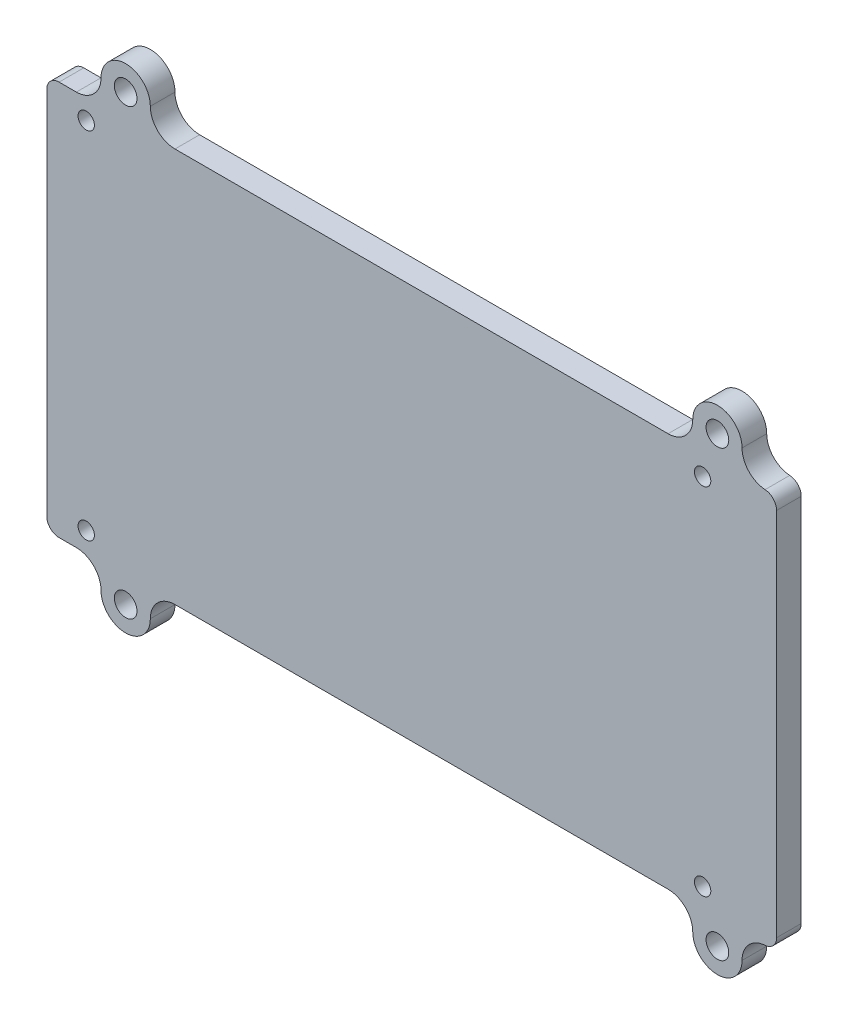
ISO-10303-21;
HEADER;
FILE_DESCRIPTION(('STEP AP214'),'2;1');
FILE_NAME('part.step','',(''),(''),'','','');
FILE_SCHEMA(('AUTOMOTIVE_DESIGN { 1 0 10303 214 1 1 1 1 }'));
ENDSEC;
DATA;
#1=APPLICATION_CONTEXT('core data for automotive mechanical design processes');
#2=APPLICATION_PROTOCOL_DEFINITION('international standard','automotive_design',2000,#1);
#3=PRODUCT_CONTEXT('',#1,'mechanical');
#4=PRODUCT('Part','Part','',(#3));
#5=PRODUCT_RELATED_PRODUCT_CATEGORY('part','',(#4));
#6=PRODUCT_DEFINITION_FORMATION('','',#4);
#7=PRODUCT_DEFINITION_CONTEXT('part definition',#1,'design');
#8=PRODUCT_DEFINITION('design','',#6,#7);
#9=PRODUCT_DEFINITION_SHAPE('','',#8);
#10=(LENGTH_UNIT() NAMED_UNIT(*) SI_UNIT(.MILLI.,.METRE.));
#11=(NAMED_UNIT(*) PLANE_ANGLE_UNIT() SI_UNIT($,.RADIAN.));
#12=(NAMED_UNIT(*) SI_UNIT($,.STERADIAN.) SOLID_ANGLE_UNIT());
#13=UNCERTAINTY_MEASURE_WITH_UNIT(LENGTH_MEASURE(1.E-05),#10,'distance_accuracy_value','');
#14=(GEOMETRIC_REPRESENTATION_CONTEXT(3) GLOBAL_UNCERTAINTY_ASSIGNED_CONTEXT((#13)) GLOBAL_UNIT_ASSIGNED_CONTEXT((#10,
#11,#12)) REPRESENTATION_CONTEXT('',''));
#15=CARTESIAN_POINT('',(0.,0.,0.));
#16=DIRECTION('',(0.,0.,1.));
#17=DIRECTION('',(1.,0.,0.));
#18=AXIS2_PLACEMENT_3D('',#15,#16,#17);
#19=CARTESIAN_POINT('',(90.805,53.975,0.));
#20=DIRECTION('',(0.,0.,1.));
#21=DIRECTION('',(1.,0.,0.));
#22=AXIS2_PLACEMENT_3D('',#19,#20,#21);
#23=CYLINDRICAL_SURFACE('',#22,3.175);
#24=DIRECTION('',(0.,0.,1.));
#25=VECTOR('',#24,1.);
#26=CARTESIAN_POINT('',(93.98,53.975,1.5875));
#27=LINE('',#26,#25);
#28=CARTESIAN_POINT('',(93.98,53.975,0.));
#29=VERTEX_POINT('',#28);
#30=CARTESIAN_POINT('',(93.98,53.975,3.175));
#31=VERTEX_POINT('',#30);
#32=EDGE_CURVE('E222',#29,#31,#27,.T.);
#33=ORIENTED_EDGE('',*,*,#32,.F.);
#34=CARTESIAN_POINT('',(90.805,53.975,0.));
#35=DIRECTION('',(0.,0.,1.));
#36=DIRECTION('',(1.,0.,0.));
#37=AXIS2_PLACEMENT_3D('',#34,#35,#36);
#38=CIRCLE('',#37,3.175);
#39=CARTESIAN_POINT('',(87.63,53.975,0.));
#40=VERTEX_POINT('',#39);
#41=EDGE_CURVE('E327',#40,#29,#38,.F.);
#42=ORIENTED_EDGE('',*,*,#41,.F.);
#43=DIRECTION('',(0.,0.,-1.));
#44=VECTOR('',#43,1.);
#45=CARTESIAN_POINT('',(87.63,53.975,1.5875));
#46=LINE('',#45,#44);
#47=CARTESIAN_POINT('',(87.63,53.975,3.175));
#48=VERTEX_POINT('',#47);
#49=EDGE_CURVE('E220',#48,#40,#46,.T.);
#50=ORIENTED_EDGE('',*,*,#49,.F.);
#51=CARTESIAN_POINT('',(90.805,53.975,3.175));
#52=DIRECTION('',(0.,0.,1.));
#53=DIRECTION('',(1.,0.,0.));
#54=AXIS2_PLACEMENT_3D('',#51,#52,#53);
#55=CIRCLE('',#54,3.175);
#56=EDGE_CURVE('E296',#31,#48,#55,.T.);
#57=ORIENTED_EDGE('',*,*,#56,.F.);
#58=EDGE_LOOP('',(#33,#42,#50,#57));
#59=FACE_BOUND('',#58,.T.);
#60=ADVANCED_FACE('F16',(#59),#23,.T.);
#61=CARTESIAN_POINT('',(84.455,53.975,3.175));
#62=DIRECTION('',(0.,0.,-1.));
#63=DIRECTION('',(-1.,0.,0.));
#64=AXIS2_PLACEMENT_3D('',#61,#62,#63);
#65=CYLINDRICAL_SURFACE('',#64,3.175);
#66=CARTESIAN_POINT('',(84.455,53.975,0.));
#67=DIRECTION('',(0.,0.,-1.));
#68=DIRECTION('',(-1.,0.,0.));
#69=AXIS2_PLACEMENT_3D('',#66,#67,#68);
#70=CIRCLE('',#69,3.175);
#71=CARTESIAN_POINT('',(84.455,50.8,0.));
#72=VERTEX_POINT('',#71);
#73=EDGE_CURVE('E329',#72,#40,#70,.F.);
#74=ORIENTED_EDGE('',*,*,#73,.F.);
#75=DIRECTION('',(0.,0.,-1.));
#76=VECTOR('',#75,1.);
#77=CARTESIAN_POINT('',(84.455,50.8,1.5875));
#78=LINE('',#77,#76);
#79=CARTESIAN_POINT('',(84.455,50.8,3.175));
#80=VERTEX_POINT('',#79);
#81=EDGE_CURVE('E218',#80,#72,#78,.T.);
#82=ORIENTED_EDGE('',*,*,#81,.F.);
#83=CARTESIAN_POINT('',(84.455,53.975,3.175));
#84=DIRECTION('',(0.,0.,-1.));
#85=DIRECTION('',(-1.,0.,0.));
#86=AXIS2_PLACEMENT_3D('',#83,#84,#85);
#87=CIRCLE('',#86,3.175);
#88=EDGE_CURVE('E293',#48,#80,#87,.T.);
#89=ORIENTED_EDGE('',*,*,#88,.F.);
#90=ORIENTED_EDGE('',*,*,#49,.T.);
#91=EDGE_LOOP('',(#74,#82,#89,#90));
#92=FACE_BOUND('',#91,.T.);
#93=ADVANCED_FACE('F454',(#92),#65,.F.);
#94=CARTESIAN_POINT('',(84.455,50.8,0.));
#95=DIRECTION('',(0.,1.,0.));
#96=DIRECTION('',(-1.,0.,0.));
#97=AXIS2_PLACEMENT_3D('',#94,#95,#96);
#98=PLANE('',#97);
#99=DIRECTION('',(0.,0.,-1.));
#100=VECTOR('',#99,1.);
#101=CARTESIAN_POINT('',(20.955,50.8,1.5875));
#102=LINE('',#101,#100);
#103=CARTESIAN_POINT('',(20.955,50.8,3.175));
#104=VERTEX_POINT('',#103);
#105=CARTESIAN_POINT('',(20.955,50.8,0.));
#106=VERTEX_POINT('',#105);
#107=EDGE_CURVE('E216',#104,#106,#102,.T.);
#108=ORIENTED_EDGE('',*,*,#107,.F.);
#109=DIRECTION('',(-1.,0.,0.));
#110=VECTOR('',#109,1.);
#111=CARTESIAN_POINT('',(51.435,50.8,3.175));
#112=LINE('',#111,#110);
#113=EDGE_CURVE('E292',#80,#104,#112,.T.);
#114=ORIENTED_EDGE('',*,*,#113,.F.);
#115=ORIENTED_EDGE('',*,*,#81,.T.);
#116=DIRECTION('',(1.,0.,0.));
#117=VECTOR('',#116,1.);
#118=CARTESIAN_POINT('',(51.435,50.8,0.));
#119=LINE('',#118,#117);
#120=EDGE_CURVE('E332',#106,#72,#119,.T.);
#121=ORIENTED_EDGE('',*,*,#120,.F.);
#122=EDGE_LOOP('',(#108,#114,#115,#121));
#123=FACE_BOUND('',#122,.T.);
#124=ADVANCED_FACE('F450',(#123),#98,.T.);
#125=CARTESIAN_POINT('',(20.955,53.975,0.));
#126=DIRECTION('',(0.,0.,1.));
#127=DIRECTION('',(1.,0.,0.));
#128=AXIS2_PLACEMENT_3D('',#125,#126,#127);
#129=CYLINDRICAL_SURFACE('',#128,3.175);
#130=CARTESIAN_POINT('',(20.955,53.975,3.175));
#131=DIRECTION('',(0.,0.,1.));
#132=DIRECTION('',(1.,0.,0.));
#133=AXIS2_PLACEMENT_3D('',#130,#131,#132);
#134=CIRCLE('',#133,3.175);
#135=CARTESIAN_POINT('',(17.78,53.975,3.175));
#136=VERTEX_POINT('',#135);
#137=EDGE_CURVE('E289',#104,#136,#134,.F.);
#138=ORIENTED_EDGE('',*,*,#137,.F.);
#139=ORIENTED_EDGE('',*,*,#107,.T.);
#140=CARTESIAN_POINT('',(20.955,53.975,0.));
#141=DIRECTION('',(0.,0.,1.));
#142=DIRECTION('',(1.,0.,0.));
#143=AXIS2_PLACEMENT_3D('',#140,#141,#142);
#144=CIRCLE('',#143,3.175);
#145=CARTESIAN_POINT('',(17.78,53.975,0.));
#146=VERTEX_POINT('',#145);
#147=EDGE_CURVE('E333',#146,#106,#144,.T.);
#148=ORIENTED_EDGE('',*,*,#147,.F.);
#149=DIRECTION('',(0.,0.,-1.));
#150=VECTOR('',#149,1.);
#151=CARTESIAN_POINT('',(17.78,53.975,1.5875));
#152=LINE('',#151,#150);
#153=EDGE_CURVE('E214',#136,#146,#152,.T.);
#154=ORIENTED_EDGE('',*,*,#153,.F.);
#155=EDGE_LOOP('',(#138,#139,#148,#154));
#156=FACE_BOUND('',#155,.T.);
#157=ADVANCED_FACE('F446',(#156),#129,.F.);
#158=CARTESIAN_POINT('',(14.605,53.975,0.));
#159=DIRECTION('',(0.,0.,1.));
#160=DIRECTION('',(1.,0.,0.));
#161=AXIS2_PLACEMENT_3D('',#158,#159,#160);
#162=CYLINDRICAL_SURFACE('',#161,3.175);
#163=DIRECTION('',(0.,0.,-1.));
#164=VECTOR('',#163,1.);
#165=CARTESIAN_POINT('',(11.43,53.975,1.5875));
#166=LINE('',#165,#164);
#167=CARTESIAN_POINT('',(11.43,53.975,3.175));
#168=VERTEX_POINT('',#167);
#169=CARTESIAN_POINT('',(11.43,53.975,0.));
#170=VERTEX_POINT('',#169);
#171=EDGE_CURVE('E212',#168,#170,#166,.T.);
#172=ORIENTED_EDGE('',*,*,#171,.F.);
#173=CARTESIAN_POINT('',(14.605,53.975,3.175));
#174=DIRECTION('',(0.,0.,1.));
#175=DIRECTION('',(1.,0.,0.));
#176=AXIS2_PLACEMENT_3D('',#173,#174,#175);
#177=CIRCLE('',#176,3.175);
#178=EDGE_CURVE('E286',#136,#168,#177,.T.);
#179=ORIENTED_EDGE('',*,*,#178,.F.);
#180=ORIENTED_EDGE('',*,*,#153,.T.);
#181=CARTESIAN_POINT('',(14.605,53.975,0.));
#182=DIRECTION('',(0.,0.,1.));
#183=DIRECTION('',(1.,0.,0.));
#184=AXIS2_PLACEMENT_3D('',#181,#182,#183);
#185=CIRCLE('',#184,3.175);
#186=EDGE_CURVE('E336',#170,#146,#185,.F.);
#187=ORIENTED_EDGE('',*,*,#186,.F.);
#188=EDGE_LOOP('',(#172,#179,#180,#187));
#189=FACE_BOUND('',#188,.T.);
#190=ADVANCED_FACE('F442',(#189),#162,.T.);
#191=CARTESIAN_POINT('',(8.255,53.975,3.175));
#192=DIRECTION('',(0.,0.,-1.));
#193=DIRECTION('',(-1.,0.,0.));
#194=AXIS2_PLACEMENT_3D('',#191,#192,#193);
#195=CYLINDRICAL_SURFACE('',#194,3.175);
#196=CARTESIAN_POINT('',(8.255,53.975,0.));
#197=DIRECTION('',(0.,0.,-1.));
#198=DIRECTION('',(-1.,0.,0.));
#199=AXIS2_PLACEMENT_3D('',#196,#197,#198);
#200=CIRCLE('',#199,3.175);
#201=CARTESIAN_POINT('',(8.25500000000001,50.8,0.));
#202=VERTEX_POINT('',#201);
#203=EDGE_CURVE('E339',#202,#170,#200,.F.);
#204=ORIENTED_EDGE('',*,*,#203,.F.);
#205=DIRECTION('',(0.,0.,-1.));
#206=VECTOR('',#205,1.);
#207=CARTESIAN_POINT('',(8.255,50.8,1.5875));
#208=LINE('',#207,#206);
#209=CARTESIAN_POINT('',(8.25500000000001,50.8,3.175));
#210=VERTEX_POINT('',#209);
#211=EDGE_CURVE('E210',#210,#202,#208,.T.);
#212=ORIENTED_EDGE('',*,*,#211,.F.);
#213=CARTESIAN_POINT('',(8.255,53.975,3.175));
#214=DIRECTION('',(0.,0.,-1.));
#215=DIRECTION('',(-1.,0.,0.));
#216=AXIS2_PLACEMENT_3D('',#213,#214,#215);
#217=CIRCLE('',#216,3.175);
#218=EDGE_CURVE('E283',#168,#210,#217,.T.);
#219=ORIENTED_EDGE('',*,*,#218,.F.);
#220=ORIENTED_EDGE('',*,*,#171,.T.);
#221=EDGE_LOOP('',(#204,#212,#219,#220));
#222=FACE_BOUND('',#221,.T.);
#223=ADVANCED_FACE('F438',(#222),#195,.F.);
#224=CARTESIAN_POINT('',(8.255,50.8,0.));
#225=DIRECTION('',(0.,1.,0.));
#226=DIRECTION('',(-1.,0.,0.));
#227=AXIS2_PLACEMENT_3D('',#224,#225,#226);
#228=PLANE('',#227);
#229=ORIENTED_EDGE('',*,*,#211,.T.);
#230=DIRECTION('',(1.,0.,0.));
#231=VECTOR('',#230,1.);
#232=CARTESIAN_POINT('',(51.435,50.8,0.));
#233=LINE('',#232,#231);
#234=CARTESIAN_POINT('',(6.03250000000001,50.8,0.));
#235=VERTEX_POINT('',#234);
#236=EDGE_CURVE('E342',#235,#202,#233,.T.);
#237=ORIENTED_EDGE('',*,*,#236,.F.);
#238=DIRECTION('',(0.,0.,-1.));
#239=VECTOR('',#238,1.);
#240=CARTESIAN_POINT('',(6.0325,50.8,1.5875));
#241=LINE('',#240,#239);
#242=CARTESIAN_POINT('',(6.03250000000001,50.8,3.175));
#243=VERTEX_POINT('',#242);
#244=EDGE_CURVE('E208',#243,#235,#241,.T.);
#245=ORIENTED_EDGE('',*,*,#244,.F.);
#246=DIRECTION('',(-1.,0.,0.));
#247=VECTOR('',#246,1.);
#248=CARTESIAN_POINT('',(51.435,50.8,3.175));
#249=LINE('',#248,#247);
#250=EDGE_CURVE('E282',#210,#243,#249,.T.);
#251=ORIENTED_EDGE('',*,*,#250,.F.);
#252=EDGE_LOOP('',(#229,#237,#245,#251));
#253=FACE_BOUND('',#252,.T.);
#254=ADVANCED_FACE('F434',(#253),#228,.T.);
#255=CARTESIAN_POINT('',(6.0325,49.2125,3.175));
#256=DIRECTION('',(0.,0.,-1.));
#257=DIRECTION('',(-1.,0.,0.));
#258=AXIS2_PLACEMENT_3D('',#255,#256,#257);
#259=CYLINDRICAL_SURFACE('',#258,1.5875);
#260=CARTESIAN_POINT('',(6.0325,49.2125,0.));
#261=DIRECTION('',(0.,0.,-1.));
#262=DIRECTION('',(-1.,0.,0.));
#263=AXIS2_PLACEMENT_3D('',#260,#261,#262);
#264=CIRCLE('',#263,1.5875);
#265=CARTESIAN_POINT('',(4.445,49.2125,0.));
#266=VERTEX_POINT('',#265);
#267=EDGE_CURVE('E343',#266,#235,#264,.T.);
#268=ORIENTED_EDGE('',*,*,#267,.F.);
#269=DIRECTION('',(0.,0.,-1.));
#270=VECTOR('',#269,1.);
#271=CARTESIAN_POINT('',(4.445,49.2125,1.5875));
#272=LINE('',#271,#270);
#273=CARTESIAN_POINT('',(4.445,49.2125,3.175));
#274=VERTEX_POINT('',#273);
#275=EDGE_CURVE('E206',#274,#266,#272,.T.);
#276=ORIENTED_EDGE('',*,*,#275,.F.);
#277=CARTESIAN_POINT('',(6.0325,49.2125,3.175));
#278=DIRECTION('',(0.,0.,-1.));
#279=DIRECTION('',(-1.,0.,0.));
#280=AXIS2_PLACEMENT_3D('',#277,#278,#279);
#281=CIRCLE('',#280,1.5875);
#282=EDGE_CURVE('E279',#243,#274,#281,.F.);
#283=ORIENTED_EDGE('',*,*,#282,.F.);
#284=ORIENTED_EDGE('',*,*,#244,.T.);
#285=EDGE_LOOP('',(#268,#276,#283,#284));
#286=FACE_BOUND('',#285,.T.);
#287=ADVANCED_FACE('F430',(#286),#259,.T.);
#288=CARTESIAN_POINT('',(4.445,1.58750000000001,3.175));
#289=DIRECTION('',(-1.,0.,0.));
#290=DIRECTION('',(0.,1.,0.));
#291=AXIS2_PLACEMENT_3D('',#288,#289,#290);
#292=PLANE('',#291);
#293=ORIENTED_EDGE('',*,*,#275,.T.);
#294=DIRECTION('',(0.,1.,0.));
#295=VECTOR('',#294,1.);
#296=CARTESIAN_POINT('',(4.445,25.4,0.));
#297=LINE('',#296,#295);
#298=CARTESIAN_POINT('',(4.445,1.58750000000001,0.));
#299=VERTEX_POINT('',#298);
#300=EDGE_CURVE('E346',#299,#266,#297,.T.);
#301=ORIENTED_EDGE('',*,*,#300,.F.);
#302=DIRECTION('',(0.,0.,-1.));
#303=VECTOR('',#302,1.);
#304=CARTESIAN_POINT('',(4.445,1.58750000000001,1.5875));
#305=LINE('',#304,#303);
#306=CARTESIAN_POINT('',(4.445,1.58750000000001,3.175));
#307=VERTEX_POINT('',#306);
#308=EDGE_CURVE('E204',#307,#299,#305,.T.);
#309=ORIENTED_EDGE('',*,*,#308,.F.);
#310=DIRECTION('',(0.,-1.,0.));
#311=VECTOR('',#310,1.);
#312=CARTESIAN_POINT('',(4.445,25.4,3.175));
#313=LINE('',#312,#311);
#314=EDGE_CURVE('E278',#274,#307,#313,.T.);
#315=ORIENTED_EDGE('',*,*,#314,.F.);
#316=EDGE_LOOP('',(#293,#301,#309,#315));
#317=FACE_BOUND('',#316,.T.);
#318=ADVANCED_FACE('F426',(#317),#292,.T.);
#319=CARTESIAN_POINT('',(6.0325,1.58750000000001,0.));
#320=DIRECTION('',(0.,0.,1.));
#321=DIRECTION('',(1.,0.,0.));
#322=AXIS2_PLACEMENT_3D('',#319,#320,#321);
#323=CYLINDRICAL_SURFACE('',#322,1.5875);
#324=CARTESIAN_POINT('',(6.0325,1.58750000000001,3.175));
#325=DIRECTION('',(0.,0.,1.));
#326=DIRECTION('',(1.,0.,0.));
#327=AXIS2_PLACEMENT_3D('',#324,#325,#326);
#328=CIRCLE('',#327,1.5875);
#329=CARTESIAN_POINT('',(6.03250000000001,0.,3.175));
#330=VERTEX_POINT('',#329);
#331=EDGE_CURVE('E275',#307,#330,#328,.T.);
#332=ORIENTED_EDGE('',*,*,#331,.F.);
#333=ORIENTED_EDGE('',*,*,#308,.T.);
#334=CARTESIAN_POINT('',(6.0325,1.58750000000001,0.));
#335=DIRECTION('',(0.,0.,1.));
#336=DIRECTION('',(1.,0.,0.));
#337=AXIS2_PLACEMENT_3D('',#334,#335,#336);
#338=CIRCLE('',#337,1.5875);
#339=CARTESIAN_POINT('',(6.03250000000001,0.,0.));
#340=VERTEX_POINT('',#339);
#341=EDGE_CURVE('E347',#340,#299,#338,.F.);
#342=ORIENTED_EDGE('',*,*,#341,.F.);
#343=DIRECTION('',(0.,0.,-1.));
#344=VECTOR('',#343,1.);
#345=CARTESIAN_POINT('',(6.0325,0.,1.5875));
#346=LINE('',#345,#344);
#347=EDGE_CURVE('E202',#330,#340,#346,.T.);
#348=ORIENTED_EDGE('',*,*,#347,.F.);
#349=EDGE_LOOP('',(#332,#333,#342,#348));
#350=FACE_BOUND('',#349,.T.);
#351=ADVANCED_FACE('F422',(#350),#323,.T.);
#352=CARTESIAN_POINT('',(6.0325,0.,0.));
#353=DIRECTION('',(0.,-1.,0.));
#354=DIRECTION('',(1.,0.,0.));
#355=AXIS2_PLACEMENT_3D('',#352,#353,#354);
#356=PLANE('',#355);
#357=DIRECTION('',(0.,0.,-1.));
#358=VECTOR('',#357,1.);
#359=CARTESIAN_POINT('',(8.255,0.,1.5875));
#360=LINE('',#359,#358);
#361=CARTESIAN_POINT('',(8.25500000000001,0.,3.175));
#362=VERTEX_POINT('',#361);
#363=CARTESIAN_POINT('',(8.25500000000001,0.,0.));
#364=VERTEX_POINT('',#363);
#365=EDGE_CURVE('E200',#362,#364,#360,.T.);
#366=ORIENTED_EDGE('',*,*,#365,.F.);
#367=DIRECTION('',(1.,0.,0.));
#368=VECTOR('',#367,1.);
#369=CARTESIAN_POINT('',(51.435,0.,3.175));
#370=LINE('',#369,#368);
#371=EDGE_CURVE('E274',#330,#362,#370,.T.);
#372=ORIENTED_EDGE('',*,*,#371,.F.);
#373=ORIENTED_EDGE('',*,*,#347,.T.);
#374=DIRECTION('',(-1.,0.,0.));
#375=VECTOR('',#374,1.);
#376=CARTESIAN_POINT('',(51.435,0.,0.));
#377=LINE('',#376,#375);
#378=EDGE_CURVE('E350',#364,#340,#377,.T.);
#379=ORIENTED_EDGE('',*,*,#378,.F.);
#380=EDGE_LOOP('',(#366,#372,#373,#379));
#381=FACE_BOUND('',#380,.T.);
#382=ADVANCED_FACE('F418',(#381),#356,.T.);
#383=CARTESIAN_POINT('',(8.255,-3.175,0.));
#384=DIRECTION('',(0.,0.,1.));
#385=DIRECTION('',(1.,0.,0.));
#386=AXIS2_PLACEMENT_3D('',#383,#384,#385);
#387=CYLINDRICAL_SURFACE('',#386,3.175);
#388=CARTESIAN_POINT('',(8.255,-3.175,3.175));
#389=DIRECTION('',(0.,0.,1.));
#390=DIRECTION('',(1.,0.,0.));
#391=AXIS2_PLACEMENT_3D('',#388,#389,#390);
#392=CIRCLE('',#391,3.175);
#393=CARTESIAN_POINT('',(11.43,-3.175,3.175));
#394=VERTEX_POINT('',#393);
#395=EDGE_CURVE('E271',#362,#394,#392,.F.);
#396=ORIENTED_EDGE('',*,*,#395,.F.);
#397=ORIENTED_EDGE('',*,*,#365,.T.);
#398=CARTESIAN_POINT('',(8.255,-3.175,0.));
#399=DIRECTION('',(0.,0.,1.));
#400=DIRECTION('',(1.,0.,0.));
#401=AXIS2_PLACEMENT_3D('',#398,#399,#400);
#402=CIRCLE('',#401,3.175);
#403=CARTESIAN_POINT('',(11.43,-3.175,0.));
#404=VERTEX_POINT('',#403);
#405=EDGE_CURVE('E351',#404,#364,#402,.T.);
#406=ORIENTED_EDGE('',*,*,#405,.F.);
#407=DIRECTION('',(0.,0.,-1.));
#408=VECTOR('',#407,1.);
#409=CARTESIAN_POINT('',(11.43,-3.175,1.5875));
#410=LINE('',#409,#408);
#411=EDGE_CURVE('E198',#394,#404,#410,.T.);
#412=ORIENTED_EDGE('',*,*,#411,.F.);
#413=EDGE_LOOP('',(#396,#397,#406,#412));
#414=FACE_BOUND('',#413,.T.);
#415=ADVANCED_FACE('F415',(#414),#387,.F.);
#416=CARTESIAN_POINT('',(14.605,-3.175,3.175));
#417=DIRECTION('',(0.,0.,-1.));
#418=DIRECTION('',(-1.,0.,0.));
#419=AXIS2_PLACEMENT_3D('',#416,#417,#418);
#420=CYLINDRICAL_SURFACE('',#419,3.175);
#421=DIRECTION('',(0.,0.,-1.));
#422=VECTOR('',#421,1.);
#423=CARTESIAN_POINT('',(17.78,-3.175,1.5875));
#424=LINE('',#423,#422);
#425=CARTESIAN_POINT('',(17.78,-3.175,3.175));
#426=VERTEX_POINT('',#425);
#427=CARTESIAN_POINT('',(17.78,-3.175,0.));
#428=VERTEX_POINT('',#427);
#429=EDGE_CURVE('E196',#426,#428,#424,.T.);
#430=ORIENTED_EDGE('',*,*,#429,.F.);
#431=CARTESIAN_POINT('',(14.605,-3.175,3.175));
#432=DIRECTION('',(0.,0.,-1.));
#433=DIRECTION('',(-1.,0.,0.));
#434=AXIS2_PLACEMENT_3D('',#431,#432,#433);
#435=CIRCLE('',#434,3.175);
#436=EDGE_CURVE('E268',#394,#426,#435,.F.);
#437=ORIENTED_EDGE('',*,*,#436,.F.);
#438=ORIENTED_EDGE('',*,*,#411,.T.);
#439=CARTESIAN_POINT('',(14.605,-3.175,0.));
#440=DIRECTION('',(0.,0.,-1.));
#441=DIRECTION('',(-1.,0.,0.));
#442=AXIS2_PLACEMENT_3D('',#439,#440,#441);
#443=CIRCLE('',#442,3.175);
#444=EDGE_CURVE('E354',#428,#404,#443,.T.);
#445=ORIENTED_EDGE('',*,*,#444,.F.);
#446=EDGE_LOOP('',(#430,#437,#438,#445));
#447=FACE_BOUND('',#446,.T.);
#448=ADVANCED_FACE('F410',(#447),#420,.T.);
#449=CARTESIAN_POINT('',(20.955,-3.175,3.175));
#450=DIRECTION('',(0.,0.,-1.));
#451=DIRECTION('',(-1.,0.,0.));
#452=AXIS2_PLACEMENT_3D('',#449,#450,#451);
#453=CYLINDRICAL_SURFACE('',#452,3.175);
#454=CARTESIAN_POINT('',(20.955,-3.175,0.));
#455=DIRECTION('',(0.,0.,-1.));
#456=DIRECTION('',(-1.,0.,0.));
#457=AXIS2_PLACEMENT_3D('',#454,#455,#456);
#458=CIRCLE('',#457,3.175);
#459=CARTESIAN_POINT('',(20.955,0.,0.));
#460=VERTEX_POINT('',#459);
#461=EDGE_CURVE('E357',#460,#428,#458,.F.);
#462=ORIENTED_EDGE('',*,*,#461,.F.);
#463=DIRECTION('',(0.,0.,-1.));
#464=VECTOR('',#463,1.);
#465=CARTESIAN_POINT('',(20.955,0.,1.5875));
#466=LINE('',#465,#464);
#467=CARTESIAN_POINT('',(20.955,0.,3.175));
#468=VERTEX_POINT('',#467);
#469=EDGE_CURVE('E194',#468,#460,#466,.T.);
#470=ORIENTED_EDGE('',*,*,#469,.F.);
#471=CARTESIAN_POINT('',(20.955,-3.175,3.175));
#472=DIRECTION('',(0.,0.,-1.));
#473=DIRECTION('',(-1.,0.,0.));
#474=AXIS2_PLACEMENT_3D('',#471,#472,#473);
#475=CIRCLE('',#474,3.175);
#476=EDGE_CURVE('E265',#426,#468,#475,.T.);
#477=ORIENTED_EDGE('',*,*,#476,.F.);
#478=ORIENTED_EDGE('',*,*,#429,.T.);
#479=EDGE_LOOP('',(#462,#470,#477,#478));
#480=FACE_BOUND('',#479,.T.);
#481=ADVANCED_FACE('F406',(#480),#453,.F.);
#482=CARTESIAN_POINT('',(20.955,0.,0.));
#483=DIRECTION('',(0.,-1.,0.));
#484=DIRECTION('',(1.,0.,0.));
#485=AXIS2_PLACEMENT_3D('',#482,#483,#484);
#486=PLANE('',#485);
#487=ORIENTED_EDGE('',*,*,#469,.T.);
#488=DIRECTION('',(-1.,0.,0.));
#489=VECTOR('',#488,1.);
#490=CARTESIAN_POINT('',(51.435,0.,0.));
#491=LINE('',#490,#489);
#492=CARTESIAN_POINT('',(84.455,0.,0.));
#493=VERTEX_POINT('',#492);
#494=EDGE_CURVE('E360',#493,#460,#491,.T.);
#495=ORIENTED_EDGE('',*,*,#494,.F.);
#496=DIRECTION('',(0.,0.,-1.));
#497=VECTOR('',#496,1.);
#498=CARTESIAN_POINT('',(84.455,0.,1.5875));
#499=LINE('',#498,#497);
#500=CARTESIAN_POINT('',(84.455,0.,3.175));
#501=VERTEX_POINT('',#500);
#502=EDGE_CURVE('E192',#501,#493,#499,.T.);
#503=ORIENTED_EDGE('',*,*,#502,.F.);
#504=DIRECTION('',(1.,0.,0.));
#505=VECTOR('',#504,1.);
#506=CARTESIAN_POINT('',(51.435,0.,3.175));
#507=LINE('',#506,#505);
#508=EDGE_CURVE('E264',#468,#501,#507,.T.);
#509=ORIENTED_EDGE('',*,*,#508,.F.);
#510=EDGE_LOOP('',(#487,#495,#503,#509));
#511=FACE_BOUND('',#510,.T.);
#512=ADVANCED_FACE('F404',(#511),#486,.T.);
#513=CARTESIAN_POINT('',(84.455,-3.175,0.));
#514=DIRECTION('',(0.,0.,1.));
#515=DIRECTION('',(1.,0.,0.));
#516=AXIS2_PLACEMENT_3D('',#513,#514,#515);
#517=CYLINDRICAL_SURFACE('',#516,3.175);
#518=CARTESIAN_POINT('',(84.455,-3.175,3.175));
#519=DIRECTION('',(0.,0.,1.));
#520=DIRECTION('',(1.,0.,0.));
#521=AXIS2_PLACEMENT_3D('',#518,#519,#520);
#522=CIRCLE('',#521,3.175);
#523=CARTESIAN_POINT('',(87.63,-3.175,3.175));
#524=VERTEX_POINT('',#523);
#525=EDGE_CURVE('E261',#501,#524,#522,.F.);
#526=ORIENTED_EDGE('',*,*,#525,.F.);
#527=ORIENTED_EDGE('',*,*,#502,.T.);
#528=CARTESIAN_POINT('',(84.455,-3.175,0.));
#529=DIRECTION('',(0.,0.,1.));
#530=DIRECTION('',(1.,0.,0.));
#531=AXIS2_PLACEMENT_3D('',#528,#529,#530);
#532=CIRCLE('',#531,3.175);
#533=CARTESIAN_POINT('',(87.63,-3.175,0.));
#534=VERTEX_POINT('',#533);
#535=EDGE_CURVE('E361',#534,#493,#532,.T.);
#536=ORIENTED_EDGE('',*,*,#535,.F.);
#537=DIRECTION('',(0.,0.,-1.));
#538=VECTOR('',#537,1.);
#539=CARTESIAN_POINT('',(87.63,-3.175,1.5875));
#540=LINE('',#539,#538);
#541=EDGE_CURVE('E190',#524,#534,#540,.T.);
#542=ORIENTED_EDGE('',*,*,#541,.F.);
#543=EDGE_LOOP('',(#526,#527,#536,#542));
#544=FACE_BOUND('',#543,.T.);
#545=ADVANCED_FACE('F376',(#544),#517,.F.);
#546=CARTESIAN_POINT('',(90.805,-3.175,3.175));
#547=DIRECTION('',(0.,0.,-1.));
#548=DIRECTION('',(-1.,0.,0.));
#549=AXIS2_PLACEMENT_3D('',#546,#547,#548);
#550=CYLINDRICAL_SURFACE('',#549,3.175);
#551=DIRECTION('',(0.,0.,-1.));
#552=VECTOR('',#551,1.);
#553=CARTESIAN_POINT('',(93.98,-3.175,1.5875));
#554=LINE('',#553,#552);
#555=CARTESIAN_POINT('',(93.98,-3.175,3.175));
#556=VERTEX_POINT('',#555);
#557=CARTESIAN_POINT('',(93.98,-3.175,0.));
#558=VERTEX_POINT('',#557);
#559=EDGE_CURVE('E188',#556,#558,#554,.T.);
#560=ORIENTED_EDGE('',*,*,#559,.F.);
#561=CARTESIAN_POINT('',(90.805,-3.175,3.175));
#562=DIRECTION('',(0.,0.,-1.));
#563=DIRECTION('',(-1.,0.,0.));
#564=AXIS2_PLACEMENT_3D('',#561,#562,#563);
#565=CIRCLE('',#564,3.175);
#566=EDGE_CURVE('E258',#524,#556,#565,.F.);
#567=ORIENTED_EDGE('',*,*,#566,.F.);
#568=ORIENTED_EDGE('',*,*,#541,.T.);
#569=CARTESIAN_POINT('',(90.805,-3.175,0.));
#570=DIRECTION('',(0.,0.,-1.));
#571=DIRECTION('',(-1.,0.,0.));
#572=AXIS2_PLACEMENT_3D('',#569,#570,#571);
#573=CIRCLE('',#572,3.175);
#574=EDGE_CURVE('E364',#558,#534,#573,.T.);
#575=ORIENTED_EDGE('',*,*,#574,.F.);
#576=EDGE_LOOP('',(#560,#567,#568,#575));
#577=FACE_BOUND('',#576,.T.);
#578=ADVANCED_FACE('F372',(#577),#550,.T.);
#579=CARTESIAN_POINT('',(97.1550000000001,-3.175,3.175));
#580=DIRECTION('',(0.,0.,-1.));
#581=DIRECTION('',(-1.,0.,0.));
#582=AXIS2_PLACEMENT_3D('',#579,#580,#581);
#583=CYLINDRICAL_SURFACE('',#582,3.17500000000003);
#584=ORIENTED_EDGE('',*,*,#559,.T.);
#585=CARTESIAN_POINT('',(97.1550000000001,-3.175,0.));
#586=DIRECTION('',(0.,0.,-1.));
#587=DIRECTION('',(-1.,0.,0.));
#588=AXIS2_PLACEMENT_3D('',#585,#586,#587);
#589=CIRCLE('',#588,3.17500000000003);
#590=CARTESIAN_POINT('',(96.9433333333334,-0.00706341253137871,0.));
#591=VERTEX_POINT('',#590);
#592=EDGE_CURVE('E173',#591,#558,#589,.F.);
#593=ORIENTED_EDGE('',*,*,#592,.F.);
#594=DIRECTION('',(0.,0.,-1.));
#595=VECTOR('',#594,1.);
#596=CARTESIAN_POINT('',(96.9433333333334,-0.00706341253139259,1.5875));
#597=LINE('',#596,#595);
#598=CARTESIAN_POINT('',(96.9433333333334,-0.00706341253137025,3.175));
#599=VERTEX_POINT('',#598);
#600=EDGE_CURVE('E169',#599,#591,#597,.T.);
#601=ORIENTED_EDGE('',*,*,#600,.F.);
#602=CARTESIAN_POINT('',(97.1550000000001,-3.175,3.175));
#603=DIRECTION('',(0.,0.,-1.));
#604=DIRECTION('',(-1.,0.,0.));
#605=AXIS2_PLACEMENT_3D('',#602,#603,#604);
#606=CIRCLE('',#605,3.17500000000003);
#607=EDGE_CURVE('E255',#556,#599,#606,.T.);
#608=ORIENTED_EDGE('',*,*,#607,.F.);
#609=EDGE_LOOP('',(#584,#593,#601,#608));
#610=FACE_BOUND('',#609,.T.);
#611=ADVANCED_FACE('F368',(#610),#583,.F.);
#612=CARTESIAN_POINT('',(90.805,-3.175,3.175));
#613=DIRECTION('',(0.,0.,-1.));
#614=DIRECTION('',(-1.,0.,0.));
#615=AXIS2_PLACEMENT_3D('',#612,#613,#614);
#616=CYLINDRICAL_SURFACE('',#615,1.4605);
#617=CARTESIAN_POINT('',(90.805,-3.175,0.));
#618=DIRECTION('',(0.,0.,-1.));
#619=DIRECTION('',(-1.,0.,0.));
#620=AXIS2_PLACEMENT_3D('',#617,#618,#619);
#621=CIRCLE('',#620,1.4605);
#622=CARTESIAN_POINT('',(89.3445,-3.175,0.));
#623=VERTEX_POINT('',#622);
#624=EDGE_CURVE('E324',#623,#623,#621,.F.);
#625=ORIENTED_EDGE('',*,*,#624,.F.);
#626=EDGE_LOOP('',(#625));
#627=FACE_BOUND('',#626,.T.);
#628=CARTESIAN_POINT('',(90.805,-3.175,3.175));
#629=DIRECTION('',(0.,0.,-1.));
#630=DIRECTION('',(-1.,0.,0.));
#631=AXIS2_PLACEMENT_3D('',#628,#629,#630);
#632=CIRCLE('',#631,1.4605);
#633=CARTESIAN_POINT('',(89.3445,-3.175,3.175));
#634=VERTEX_POINT('',#633);
#635=EDGE_CURVE('E250',#634,#634,#632,.T.);
#636=ORIENTED_EDGE('',*,*,#635,.F.);
#637=EDGE_LOOP('',(#636));
#638=FACE_BOUND('',#637,.T.);
#639=ADVANCED_FACE('F508',(#627,#638),#616,.F.);
#640=CARTESIAN_POINT('',(90.805,53.975,0.));
#641=DIRECTION('',(0.,0.,1.));
#642=DIRECTION('',(1.,0.,0.));
#643=AXIS2_PLACEMENT_3D('',#640,#641,#642);
#644=CYLINDRICAL_SURFACE('',#643,1.46049999999999);
#645=CARTESIAN_POINT('',(90.805,53.975,0.));
#646=DIRECTION('',(0.,0.,1.));
#647=DIRECTION('',(1.,0.,0.));
#648=AXIS2_PLACEMENT_3D('',#645,#646,#647);
#649=CIRCLE('',#648,1.46049999999999);
#650=CARTESIAN_POINT('',(92.2655,53.975,0.));
#651=VERTEX_POINT('',#650);
#652=EDGE_CURVE('E321',#651,#651,#649,.T.);
#653=ORIENTED_EDGE('',*,*,#652,.F.);
#654=EDGE_LOOP('',(#653));
#655=FACE_BOUND('',#654,.T.);
#656=CARTESIAN_POINT('',(90.805,53.975,3.175));
#657=DIRECTION('',(0.,0.,1.));
#658=DIRECTION('',(1.,0.,0.));
#659=AXIS2_PLACEMENT_3D('',#656,#657,#658);
#660=CIRCLE('',#659,1.46049999999999);
#661=CARTESIAN_POINT('',(92.2655,53.975,3.175));
#662=VERTEX_POINT('',#661);
#663=EDGE_CURVE('E247',#662,#662,#660,.F.);
#664=ORIENTED_EDGE('',*,*,#663,.F.);
#665=EDGE_LOOP('',(#664));
#666=FACE_BOUND('',#665,.T.);
#667=ADVANCED_FACE('F504',(#655,#666),#644,.F.);
#668=CARTESIAN_POINT('',(14.605,-3.175,3.175));
#669=DIRECTION('',(0.,0.,-1.));
#670=DIRECTION('',(-1.,0.,0.));
#671=AXIS2_PLACEMENT_3D('',#668,#669,#670);
#672=CYLINDRICAL_SURFACE('',#671,1.4605);
#673=CARTESIAN_POINT('',(14.605,-3.175,0.));
#674=DIRECTION('',(0.,0.,-1.));
#675=DIRECTION('',(-1.,0.,0.));
#676=AXIS2_PLACEMENT_3D('',#673,#674,#675);
#677=CIRCLE('',#676,1.4605);
#678=CARTESIAN_POINT('',(13.1445,-3.175,0.));
#679=VERTEX_POINT('',#678);
#680=EDGE_CURVE('E318',#679,#679,#677,.F.);
#681=ORIENTED_EDGE('',*,*,#680,.F.);
#682=EDGE_LOOP('',(#681));
#683=FACE_BOUND('',#682,.T.);
#684=CARTESIAN_POINT('',(14.605,-3.175,3.175));
#685=DIRECTION('',(0.,0.,-1.));
#686=DIRECTION('',(-1.,0.,0.));
#687=AXIS2_PLACEMENT_3D('',#684,#685,#686);
#688=CIRCLE('',#687,1.4605);
#689=CARTESIAN_POINT('',(13.1445,-3.175,3.175));
#690=VERTEX_POINT('',#689);
#691=EDGE_CURVE('E244',#690,#690,#688,.T.);
#692=ORIENTED_EDGE('',*,*,#691,.F.);
#693=EDGE_LOOP('',(#692));
#694=FACE_BOUND('',#693,.T.);
#695=ADVANCED_FACE('F500',(#683,#694),#672,.F.);
#696=CARTESIAN_POINT('',(14.605,53.975,0.));
#697=DIRECTION('',(0.,0.,1.));
#698=DIRECTION('',(1.,0.,0.));
#699=AXIS2_PLACEMENT_3D('',#696,#697,#698);
#700=CYLINDRICAL_SURFACE('',#699,1.4605);
#701=CARTESIAN_POINT('',(14.605,53.975,0.));
#702=DIRECTION('',(0.,0.,1.));
#703=DIRECTION('',(1.,0.,0.));
#704=AXIS2_PLACEMENT_3D('',#701,#702,#703);
#705=CIRCLE('',#704,1.4605);
#706=CARTESIAN_POINT('',(16.0655,53.975,0.));
#707=VERTEX_POINT('',#706);
#708=EDGE_CURVE('E315',#707,#707,#705,.T.);
#709=ORIENTED_EDGE('',*,*,#708,.F.);
#710=EDGE_LOOP('',(#709));
#711=FACE_BOUND('',#710,.T.);
#712=CARTESIAN_POINT('',(14.605,53.975,3.175));
#713=DIRECTION('',(0.,0.,1.));
#714=DIRECTION('',(1.,0.,0.));
#715=AXIS2_PLACEMENT_3D('',#712,#713,#714);
#716=CIRCLE('',#715,1.4605);
#717=CARTESIAN_POINT('',(16.0655,53.975,3.175));
#718=VERTEX_POINT('',#717);
#719=EDGE_CURVE('E241',#718,#718,#716,.F.);
#720=ORIENTED_EDGE('',*,*,#719,.F.);
#721=EDGE_LOOP('',(#720));
#722=FACE_BOUND('',#721,.T.);
#723=ADVANCED_FACE('F496',(#711,#722),#700,.F.);
#724=CARTESIAN_POINT('',(88.9,2.54,0.));
#725=DIRECTION('',(0.,0.,1.));
#726=DIRECTION('',(1.,0.,0.));
#727=AXIS2_PLACEMENT_3D('',#724,#725,#726);
#728=CYLINDRICAL_SURFACE('',#727,1.0541);
#729=CARTESIAN_POINT('',(88.9,2.54,0.));
#730=DIRECTION('',(0.,0.,1.));
#731=DIRECTION('',(1.,0.,0.));
#732=AXIS2_PLACEMENT_3D('',#729,#730,#731);
#733=CIRCLE('',#732,1.0541);
#734=CARTESIAN_POINT('',(89.9541,2.54,0.));
#735=VERTEX_POINT('',#734);
#736=EDGE_CURVE('E303',#735,#735,#733,.T.);
#737=ORIENTED_EDGE('',*,*,#736,.F.);
#738=EDGE_LOOP('',(#737));
#739=FACE_BOUND('',#738,.T.);
#740=CARTESIAN_POINT('',(88.9,2.54,3.175));
#741=DIRECTION('',(0.,0.,1.));
#742=DIRECTION('',(1.,0.,0.));
#743=AXIS2_PLACEMENT_3D('',#740,#741,#742);
#744=CIRCLE('',#743,1.0541);
#745=CARTESIAN_POINT('',(89.9541,2.54,3.175));
#746=VERTEX_POINT('',#745);
#747=EDGE_CURVE('E238',#746,#746,#744,.F.);
#748=ORIENTED_EDGE('',*,*,#747,.F.);
#749=EDGE_LOOP('',(#748));
#750=FACE_BOUND('',#749,.T.);
#751=ADVANCED_FACE('F492',(#739,#750),#728,.F.);
#752=CARTESIAN_POINT('',(9.525,48.26,0.));
#753=DIRECTION('',(0.,0.,1.));
#754=DIRECTION('',(1.,0.,0.));
#755=AXIS2_PLACEMENT_3D('',#752,#753,#754);
#756=CYLINDRICAL_SURFACE('',#755,1.05409999999999);
#757=CARTESIAN_POINT('',(9.525,48.26,0.));
#758=DIRECTION('',(0.,0.,1.));
#759=DIRECTION('',(1.,0.,0.));
#760=AXIS2_PLACEMENT_3D('',#757,#758,#759);
#761=CIRCLE('',#760,1.05409999999999);
#762=CARTESIAN_POINT('',(10.5791,48.26,0.));
#763=VERTEX_POINT('',#762);
#764=EDGE_CURVE('E306',#763,#763,#761,.T.);
#765=ORIENTED_EDGE('',*,*,#764,.F.);
#766=EDGE_LOOP('',(#765));
#767=FACE_BOUND('',#766,.T.);
#768=CARTESIAN_POINT('',(9.525,48.26,3.175));
#769=DIRECTION('',(0.,0.,1.));
#770=DIRECTION('',(1.,0.,0.));
#771=AXIS2_PLACEMENT_3D('',#768,#769,#770);
#772=CIRCLE('',#771,1.05409999999999);
#773=CARTESIAN_POINT('',(10.5791,48.26,3.175));
#774=VERTEX_POINT('',#773);
#775=EDGE_CURVE('E235',#774,#774,#772,.F.);
#776=ORIENTED_EDGE('',*,*,#775,.F.);
#777=EDGE_LOOP('',(#776));
#778=FACE_BOUND('',#777,.T.);
#779=ADVANCED_FACE('F488',(#767,#778),#756,.F.);
#780=CARTESIAN_POINT('',(9.525,2.54,0.));
#781=DIRECTION('',(0.,0.,1.));
#782=DIRECTION('',(1.,0.,0.));
#783=AXIS2_PLACEMENT_3D('',#780,#781,#782);
#784=CYLINDRICAL_SURFACE('',#783,1.0541);
#785=CARTESIAN_POINT('',(9.525,2.54,0.));
#786=DIRECTION('',(0.,0.,1.));
#787=DIRECTION('',(1.,0.,0.));
#788=AXIS2_PLACEMENT_3D('',#785,#786,#787);
#789=CIRCLE('',#788,1.0541);
#790=CARTESIAN_POINT('',(10.5791,2.54,0.));
#791=VERTEX_POINT('',#790);
#792=EDGE_CURVE('E309',#791,#791,#789,.T.);
#793=ORIENTED_EDGE('',*,*,#792,.F.);
#794=EDGE_LOOP('',(#793));
#795=FACE_BOUND('',#794,.T.);
#796=CARTESIAN_POINT('',(9.525,2.54,3.175));
#797=DIRECTION('',(0.,0.,1.));
#798=DIRECTION('',(1.,0.,0.));
#799=AXIS2_PLACEMENT_3D('',#796,#797,#798);
#800=CIRCLE('',#799,1.0541);
#801=CARTESIAN_POINT('',(10.5791,2.54,3.175));
#802=VERTEX_POINT('',#801);
#803=EDGE_CURVE('E232',#802,#802,#800,.F.);
#804=ORIENTED_EDGE('',*,*,#803,.F.);
#805=EDGE_LOOP('',(#804));
#806=FACE_BOUND('',#805,.T.);
#807=ADVANCED_FACE('F484',(#795,#806),#784,.F.);
#808=CARTESIAN_POINT('',(88.9,48.26,0.));
#809=DIRECTION('',(0.,0.,1.));
#810=DIRECTION('',(1.,0.,0.));
#811=AXIS2_PLACEMENT_3D('',#808,#809,#810);
#812=CYLINDRICAL_SURFACE('',#811,1.0541);
#813=CARTESIAN_POINT('',(88.9,48.26,0.));
#814=DIRECTION('',(0.,0.,1.));
#815=DIRECTION('',(1.,0.,0.));
#816=AXIS2_PLACEMENT_3D('',#813,#814,#815);
#817=CIRCLE('',#816,1.0541);
#818=CARTESIAN_POINT('',(89.9541,48.26,0.));
#819=VERTEX_POINT('',#818);
#820=EDGE_CURVE('E312',#819,#819,#817,.T.);
#821=ORIENTED_EDGE('',*,*,#820,.F.);
#822=EDGE_LOOP('',(#821));
#823=FACE_BOUND('',#822,.T.);
#824=CARTESIAN_POINT('',(88.9,48.26,3.175));
#825=DIRECTION('',(0.,0.,1.));
#826=DIRECTION('',(1.,0.,0.));
#827=AXIS2_PLACEMENT_3D('',#824,#825,#826);
#828=CIRCLE('',#827,1.0541);
#829=CARTESIAN_POINT('',(89.9541,48.26,3.175));
#830=VERTEX_POINT('',#829);
#831=EDGE_CURVE('E183',#830,#830,#828,.F.);
#832=ORIENTED_EDGE('',*,*,#831,.F.);
#833=EDGE_LOOP('',(#832));
#834=FACE_BOUND('',#833,.T.);
#835=ADVANCED_FACE('F481',(#823,#834),#812,.F.);
#836=CARTESIAN_POINT('',(96.8375000000001,1.57690488120292,0.));
#837=DIRECTION('',(0.,0.,1.));
#838=DIRECTION('',(1.,0.,0.));
#839=AXIS2_PLACEMENT_3D('',#836,#837,#838);
#840=CYLINDRICAL_SURFACE('',#839,1.58749999999997);
#841=CARTESIAN_POINT('',(96.8375000000001,1.57690488120292,0.));
#842=DIRECTION('',(0.,0.,1.));
#843=DIRECTION('',(1.,0.,0.));
#844=AXIS2_PLACEMENT_3D('',#841,#842,#843);
#845=CIRCLE('',#844,1.58749999999997);
#846=CARTESIAN_POINT('',(98.425,1.57690488120291,0.));
#847=VERTEX_POINT('',#846);
#848=EDGE_CURVE('E20',#847,#591,#845,.F.);
#849=ORIENTED_EDGE('',*,*,#848,.F.);
#850=DIRECTION('',(0.,0.,-1.));
#851=VECTOR('',#850,1.);
#852=CARTESIAN_POINT('',(98.425,1.5769048812029,1.5875));
#853=LINE('',#852,#851);
#854=CARTESIAN_POINT('',(98.425,1.57690488120291,3.175));
#855=VERTEX_POINT('',#854);
#856=EDGE_CURVE('E168',#855,#847,#853,.T.);
#857=ORIENTED_EDGE('',*,*,#856,.F.);
#858=CARTESIAN_POINT('',(96.8375000000001,1.57690488120292,3.175));
#859=DIRECTION('',(0.,0.,1.));
#860=DIRECTION('',(1.,0.,0.));
#861=AXIS2_PLACEMENT_3D('',#858,#859,#860);
#862=CIRCLE('',#861,1.58749999999997);
#863=EDGE_CURVE('E253',#599,#855,#862,.T.);
#864=ORIENTED_EDGE('',*,*,#863,.F.);
#865=ORIENTED_EDGE('',*,*,#600,.T.);
#866=EDGE_LOOP('',(#849,#857,#864,#865));
#867=FACE_BOUND('',#866,.T.);
#868=ADVANCED_FACE('F165',(#867),#840,.T.);
#869=CARTESIAN_POINT('',(98.425,-6.985,0.));
#870=DIRECTION('',(0.,0.,-1.));
#871=DIRECTION('',(-1.,0.,0.));
#872=AXIS2_PLACEMENT_3D('',#869,#870,#871);
#873=PLANE('',#872);
#874=ORIENTED_EDGE('',*,*,#736,.T.);
#875=EDGE_LOOP('',(#874));
#876=FACE_BOUND('',#875,.T.);
#877=ORIENTED_EDGE('',*,*,#764,.T.);
#878=EDGE_LOOP('',(#877));
#879=FACE_BOUND('',#878,.T.);
#880=ORIENTED_EDGE('',*,*,#792,.T.);
#881=EDGE_LOOP('',(#880));
#882=FACE_BOUND('',#881,.T.);
#883=ORIENTED_EDGE('',*,*,#820,.T.);
#884=EDGE_LOOP('',(#883));
#885=FACE_BOUND('',#884,.T.);
#886=ORIENTED_EDGE('',*,*,#708,.T.);
#887=EDGE_LOOP('',(#886));
#888=FACE_BOUND('',#887,.T.);
#889=ORIENTED_EDGE('',*,*,#680,.T.);
#890=EDGE_LOOP('',(#889));
#891=FACE_BOUND('',#890,.T.);
#892=ORIENTED_EDGE('',*,*,#652,.T.);
#893=EDGE_LOOP('',(#892));
#894=FACE_BOUND('',#893,.T.);
#895=ORIENTED_EDGE('',*,*,#624,.T.);
#896=EDGE_LOOP('',(#895));
#897=FACE_BOUND('',#896,.T.);
#898=ORIENTED_EDGE('',*,*,#41,.T.);
#899=CARTESIAN_POINT('',(97.1549999999998,53.975,0.));
#900=DIRECTION('',(0.,0.,1.));
#901=DIRECTION('',(1.,0.,0.));
#902=AXIS2_PLACEMENT_3D('',#899,#900,#901);
#903=CIRCLE('',#902,3.17499999999984);
#904=CARTESIAN_POINT('',(96.9433333333334,50.8070634125315,0.));
#905=VERTEX_POINT('',#904);
#906=EDGE_CURVE('E225',#905,#29,#903,.F.);
#907=ORIENTED_EDGE('',*,*,#906,.F.);
#908=CARTESIAN_POINT('',(96.8375,49.223095118797,0.));
#909=DIRECTION('',(0.,0.,-1.));
#910=DIRECTION('',(-1.,0.,0.));
#911=AXIS2_PLACEMENT_3D('',#908,#909,#910);
#912=CIRCLE('',#911,1.58750000000008);
#913=CARTESIAN_POINT('',(98.425,49.223095118797,0.));
#914=VERTEX_POINT('',#913);
#915=EDGE_CURVE('E178',#914,#905,#912,.F.);
#916=ORIENTED_EDGE('',*,*,#915,.F.);
#917=DIRECTION('',(0.,1.,0.));
#918=VECTOR('',#917,1.);
#919=CARTESIAN_POINT('',(98.425,25.4,0.));
#920=LINE('',#919,#918);
#921=EDGE_CURVE('E175',#847,#914,#920,.T.);
#922=ORIENTED_EDGE('',*,*,#921,.F.);
#923=ORIENTED_EDGE('',*,*,#848,.T.);
#924=ORIENTED_EDGE('',*,*,#592,.T.);
#925=ORIENTED_EDGE('',*,*,#574,.T.);
#926=ORIENTED_EDGE('',*,*,#535,.T.);
#927=ORIENTED_EDGE('',*,*,#494,.T.);
#928=ORIENTED_EDGE('',*,*,#461,.T.);
#929=ORIENTED_EDGE('',*,*,#444,.T.);
#930=ORIENTED_EDGE('',*,*,#405,.T.);
#931=ORIENTED_EDGE('',*,*,#378,.T.);
#932=ORIENTED_EDGE('',*,*,#341,.T.);
#933=ORIENTED_EDGE('',*,*,#300,.T.);
#934=ORIENTED_EDGE('',*,*,#267,.T.);
#935=ORIENTED_EDGE('',*,*,#236,.T.);
#936=ORIENTED_EDGE('',*,*,#203,.T.);
#937=ORIENTED_EDGE('',*,*,#186,.T.);
#938=ORIENTED_EDGE('',*,*,#147,.T.);
#939=ORIENTED_EDGE('',*,*,#120,.T.);
#940=ORIENTED_EDGE('',*,*,#73,.T.);
#941=EDGE_LOOP('',(#898,#907,#916,#922,#923,#924,#925,#926,#927,#928,#929,#930,#931,#932,#933,
#934,#935,#936,#937,#938,#939,#940));
#942=FACE_BOUND('',#941,.T.);
#943=ADVANCED_FACE('F176',(#876,#879,#882,#885,#888,#891,#894,#897,#942),#873,.T.);
#944=CARTESIAN_POINT('',(97.1549999999998,53.975,0.));
#945=DIRECTION('',(0.,0.,1.));
#946=DIRECTION('',(1.,0.,0.));
#947=AXIS2_PLACEMENT_3D('',#944,#945,#946);
#948=CYLINDRICAL_SURFACE('',#947,3.17499999999984);
#949=ORIENTED_EDGE('',*,*,#32,.T.);
#950=CARTESIAN_POINT('',(97.1549999999998,53.975,3.175));
#951=DIRECTION('',(0.,0.,1.));
#952=DIRECTION('',(1.,0.,0.));
#953=AXIS2_PLACEMENT_3D('',#950,#951,#952);
#954=CIRCLE('',#953,3.17499999999984);
#955=CARTESIAN_POINT('',(96.9433333333334,50.8070634125315,3.175));
#956=VERTEX_POINT('',#955);
#957=EDGE_CURVE('E224',#956,#31,#954,.F.);
#958=ORIENTED_EDGE('',*,*,#957,.F.);
#959=DIRECTION('',(0.,0.,1.));
#960=VECTOR('',#959,1.);
#961=CARTESIAN_POINT('',(96.9433333333334,50.8070634125315,1.5875));
#962=LINE('',#961,#960);
#963=EDGE_CURVE('E228',#905,#956,#962,.T.);
#964=ORIENTED_EDGE('',*,*,#963,.F.);
#965=ORIENTED_EDGE('',*,*,#906,.T.);
#966=EDGE_LOOP('',(#949,#958,#964,#965));
#967=FACE_BOUND('',#966,.T.);
#968=ADVANCED_FACE('F461',(#967),#948,.F.);
#969=CARTESIAN_POINT('',(4.445,-6.985,3.175));
#970=DIRECTION('',(0.,0.,1.));
#971=DIRECTION('',(1.,0.,0.));
#972=AXIS2_PLACEMENT_3D('',#969,#970,#971);
#973=PLANE('',#972);
#974=ORIENTED_EDGE('',*,*,#831,.T.);
#975=EDGE_LOOP('',(#974));
#976=FACE_BOUND('',#975,.T.);
#977=ORIENTED_EDGE('',*,*,#803,.T.);
#978=EDGE_LOOP('',(#977));
#979=FACE_BOUND('',#978,.T.);
#980=ORIENTED_EDGE('',*,*,#775,.T.);
#981=EDGE_LOOP('',(#980));
#982=FACE_BOUND('',#981,.T.);
#983=ORIENTED_EDGE('',*,*,#747,.T.);
#984=EDGE_LOOP('',(#983));
#985=FACE_BOUND('',#984,.T.);
#986=ORIENTED_EDGE('',*,*,#719,.T.);
#987=EDGE_LOOP('',(#986));
#988=FACE_BOUND('',#987,.T.);
#989=ORIENTED_EDGE('',*,*,#691,.T.);
#990=EDGE_LOOP('',(#989));
#991=FACE_BOUND('',#990,.T.);
#992=ORIENTED_EDGE('',*,*,#663,.T.);
#993=EDGE_LOOP('',(#992));
#994=FACE_BOUND('',#993,.T.);
#995=ORIENTED_EDGE('',*,*,#635,.T.);
#996=EDGE_LOOP('',(#995));
#997=FACE_BOUND('',#996,.T.);
#998=ORIENTED_EDGE('',*,*,#863,.T.);
#999=DIRECTION('',(0.,-1.,0.));
#1000=VECTOR('',#999,1.);
#1001=CARTESIAN_POINT('',(98.425,25.4,3.175));
#1002=LINE('',#1001,#1000);
#1003=CARTESIAN_POINT('',(98.425,49.223095118797,3.175));
#1004=VERTEX_POINT('',#1003);
#1005=EDGE_CURVE('E35',#1004,#855,#1002,.T.);
#1006=ORIENTED_EDGE('',*,*,#1005,.F.);
#1007=CARTESIAN_POINT('',(96.8375,49.223095118797,3.175));
#1008=DIRECTION('',(0.,0.,-1.));
#1009=DIRECTION('',(-1.,0.,0.));
#1010=AXIS2_PLACEMENT_3D('',#1007,#1008,#1009);
#1011=CIRCLE('',#1010,1.58750000000008);
#1012=EDGE_CURVE('E26',#956,#1004,#1011,.T.);
#1013=ORIENTED_EDGE('',*,*,#1012,.F.);
#1014=ORIENTED_EDGE('',*,*,#957,.T.);
#1015=ORIENTED_EDGE('',*,*,#56,.T.);
#1016=ORIENTED_EDGE('',*,*,#88,.T.);
#1017=ORIENTED_EDGE('',*,*,#113,.T.);
#1018=ORIENTED_EDGE('',*,*,#137,.T.);
#1019=ORIENTED_EDGE('',*,*,#178,.T.);
#1020=ORIENTED_EDGE('',*,*,#218,.T.);
#1021=ORIENTED_EDGE('',*,*,#250,.T.);
#1022=ORIENTED_EDGE('',*,*,#282,.T.);
#1023=ORIENTED_EDGE('',*,*,#314,.T.);
#1024=ORIENTED_EDGE('',*,*,#331,.T.);
#1025=ORIENTED_EDGE('',*,*,#371,.T.);
#1026=ORIENTED_EDGE('',*,*,#395,.T.);
#1027=ORIENTED_EDGE('',*,*,#436,.T.);
#1028=ORIENTED_EDGE('',*,*,#476,.T.);
#1029=ORIENTED_EDGE('',*,*,#508,.T.);
#1030=ORIENTED_EDGE('',*,*,#525,.T.);
#1031=ORIENTED_EDGE('',*,*,#566,.T.);
#1032=ORIENTED_EDGE('',*,*,#607,.T.);
#1033=EDGE_LOOP('',(#998,#1006,#1013,#1014,#1015,#1016,#1017,#1018,#1019,#1020,#1021,#1022,
#1023,#1024,#1025,#1026,#1027,#1028,#1029,#1030,#1031,#1032));
#1034=FACE_BOUND('',#1033,.T.);
#1035=ADVANCED_FACE('F402',(#976,#979,#982,#985,#988,#991,#994,#997,#1034),#973,.T.);
#1036=CARTESIAN_POINT('',(98.425,49.223095118797,3.175));
#1037=DIRECTION('',(1.,0.,0.));
#1038=DIRECTION('',(0.,-1.,0.));
#1039=AXIS2_PLACEMENT_3D('',#1036,#1037,#1038);
#1040=PLANE('',#1039);
#1041=ORIENTED_EDGE('',*,*,#856,.T.);
#1042=ORIENTED_EDGE('',*,*,#921,.T.);
#1043=DIRECTION('',(0.,0.,-1.));
#1044=VECTOR('',#1043,1.);
#1045=CARTESIAN_POINT('',(98.425,49.223095118797,1.5875));
#1046=LINE('',#1045,#1044);
#1047=EDGE_CURVE('E11',#1004,#914,#1046,.T.);
#1048=ORIENTED_EDGE('',*,*,#1047,.F.);
#1049=ORIENTED_EDGE('',*,*,#1005,.T.);
#1050=EDGE_LOOP('',(#1041,#1042,#1048,#1049));
#1051=FACE_BOUND('',#1050,.T.);
#1052=ADVANCED_FACE('F181',(#1051),#1040,.T.);
#1053=CARTESIAN_POINT('',(96.8375,49.223095118797,3.175));
#1054=DIRECTION('',(0.,0.,-1.));
#1055=DIRECTION('',(-1.,0.,0.));
#1056=AXIS2_PLACEMENT_3D('',#1053,#1054,#1055);
#1057=CYLINDRICAL_SURFACE('',#1056,1.58750000000008);
#1058=ORIENTED_EDGE('',*,*,#1012,.T.);
#1059=ORIENTED_EDGE('',*,*,#1047,.T.);
#1060=ORIENTED_EDGE('',*,*,#915,.T.);
#1061=ORIENTED_EDGE('',*,*,#963,.T.);
#1062=EDGE_LOOP('',(#1058,#1059,#1060,#1061));
#1063=FACE_BOUND('',#1062,.T.);
#1064=ADVANCED_FACE('F18',(#1063),#1057,.T.);
#1065=CLOSED_SHELL('',(#60,#93,#124,#157,#190,#223,#254,#287,#318,#351,#382,#415,#448,#481,#512,
#545,#578,#611,#639,#667,#695,#723,#751,#779,#807,#835,#868,#943,#968,#1035,#1052,#1064));
#1066=MANIFOLD_SOLID_BREP('B1',#1065);
#1067=ADVANCED_BREP_SHAPE_REPRESENTATION('',(#18,#1066),#14);
#1068=SHAPE_DEFINITION_REPRESENTATION(#9,#1067);
ENDSEC;
END-ISO-10303-21;
